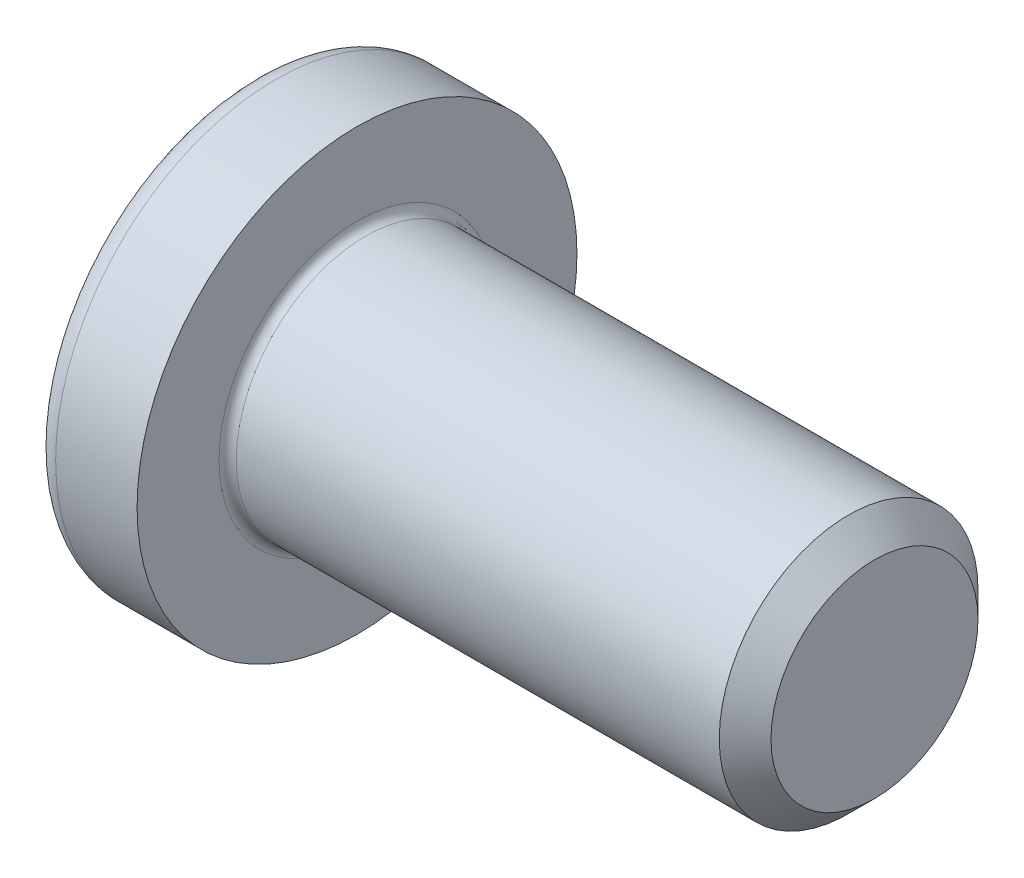
ISO-10303-21;
HEADER;
FILE_DESCRIPTION(('STEP AP214'),'2;1');
FILE_NAME('part.step','',(''),(''),'','','');
FILE_SCHEMA(('AUTOMOTIVE_DESIGN { 1 0 10303 214 1 1 1 1 }'));
ENDSEC;
DATA;
#1=APPLICATION_CONTEXT('core data for automotive mechanical design processes');
#2=APPLICATION_PROTOCOL_DEFINITION('international standard','automotive_design',2000,#1);
#3=PRODUCT_CONTEXT('',#1,'mechanical');
#4=PRODUCT('Part','Part','',(#3));
#5=PRODUCT_RELATED_PRODUCT_CATEGORY('part','',(#4));
#6=PRODUCT_DEFINITION_FORMATION('','',#4);
#7=PRODUCT_DEFINITION_CONTEXT('part definition',#1,'design');
#8=PRODUCT_DEFINITION('design','',#6,#7);
#9=PRODUCT_DEFINITION_SHAPE('','',#8);
#10=(LENGTH_UNIT() NAMED_UNIT(*) SI_UNIT(.MILLI.,.METRE.));
#11=(NAMED_UNIT(*) PLANE_ANGLE_UNIT() SI_UNIT($,.RADIAN.));
#12=(NAMED_UNIT(*) SI_UNIT($,.STERADIAN.) SOLID_ANGLE_UNIT());
#13=UNCERTAINTY_MEASURE_WITH_UNIT(LENGTH_MEASURE(1.E-05),#10,'distance_accuracy_value','');
#14=(GEOMETRIC_REPRESENTATION_CONTEXT(3) GLOBAL_UNCERTAINTY_ASSIGNED_CONTEXT((#13)) GLOBAL_UNIT_ASSIGNED_CONTEXT((#10,
#11,#12)) REPRESENTATION_CONTEXT('',''));
#15=CARTESIAN_POINT('',(0.,0.,0.));
#16=DIRECTION('',(0.,0.,1.));
#17=DIRECTION('',(1.,0.,0.));
#18=AXIS2_PLACEMENT_3D('',#15,#16,#17);
#19=CARTESIAN_POINT('',(5.,0.,0.));
#20=DIRECTION('',(-1.,0.,0.));
#21=DIRECTION('',(0.,1.,0.));
#22=AXIS2_PLACEMENT_3D('',#19,#20,#21);
#23=SPHERICAL_SURFACE('',#22,5.);
#24=CARTESIAN_POINT('',(0.619225335758571,0.,0.));
#25=DIRECTION('',(-1.,0.,0.));
#26=DIRECTION('',(0.,0.,1.));
#27=AXIS2_PLACEMENT_3D('',#24,#25,#26);
#28=CIRCLE('',#27,2.41014799154334);
#29=CARTESIAN_POINT('',(0.619225335758571,0.,2.41014799154334));
#30=VERTEX_POINT('',#29);
#31=EDGE_CURVE('E343',#30,#30,#28,.T.);
#32=ORIENTED_EDGE('',*,*,#31,.T.);
#33=EDGE_LOOP('',(#32));
#34=FACE_BOUND('',#33,.T.);
#35=CARTESIAN_POINT('',(0.04579512008964,0.,0.));
#36=DIRECTION('',(1.,0.,0.));
#37=DIRECTION('',(0.,0.,-1.));
#38=AXIS2_PLACEMENT_3D('',#35,#36,#37);
#39=CIRCLE('',#38,0.675169614150692);
#40=CARTESIAN_POINT('',(0.0457951200896384,-0.449999999999998,-0.503342833337673));
#41=VERTEX_POINT('',#40);
#42=CARTESIAN_POINT('',(0.0457951201179364,-0.503342833335017,-0.45));
#43=VERTEX_POINT('',#42);
#44=EDGE_CURVE('E391',#41,#43,#39,.F.);
#45=ORIENTED_EDGE('',*,*,#44,.F.);
#46=CARTESIAN_POINT('',(5.,-0.45,0.));
#47=DIRECTION('',(0.,1.,0.));
#48=DIRECTION('',(0.,0.,1.));
#49=AXIS2_PLACEMENT_3D('',#46,#47,#48);
#50=CIRCLE('',#49,4.97970882682914);
#51=CARTESIAN_POINT('',(0.286729744391537,-0.449999999999994,-1.60704184687163));
#52=VERTEX_POINT('',#51);
#53=EDGE_CURVE('E409',#52,#41,#50,.T.);
#54=ORIENTED_EDGE('',*,*,#53,.F.);
#55=CARTESIAN_POINT('',(4.70334382550035,0.,0.595000335588224));
#56=DIRECTION('',(0.446197753347436,0.,-0.894934391398443));
#57=DIRECTION('',(-0.894934391398442,0.,-0.446197753347436));
#58=AXIS2_PLACEMENT_3D('',#55,#56,#57);
#59=CIRCLE('',#58,4.95559983400407);
#60=CARTESIAN_POINT('',(0.286729744391538,0.450000000000006,-1.60704184687162));
#61=VERTEX_POINT('',#60);
#62=EDGE_CURVE('E238',#52,#61,#59,.T.);
#63=ORIENTED_EDGE('',*,*,#62,.T.);
#64=CARTESIAN_POINT('',(5.,0.45,0.));
#65=DIRECTION('',(0.,-1.,0.));
#66=DIRECTION('',(0.,0.,-1.));
#67=AXIS2_PLACEMENT_3D('',#64,#65,#66);
#68=CIRCLE('',#67,4.97970882682914);
#69=CARTESIAN_POINT('',(0.0457951200896617,0.450000000000002,-0.503342833337888));
#70=VERTEX_POINT('',#69);
#71=EDGE_CURVE('E332',#70,#61,#68,.T.);
#72=ORIENTED_EDGE('',*,*,#71,.F.);
#73=CARTESIAN_POINT('',(0.0457951200896401,0.503342833337671,-0.45));
#74=VERTEX_POINT('',#73);
#75=EDGE_CURVE('E389',#74,#70,#39,.F.);
#76=ORIENTED_EDGE('',*,*,#75,.F.);
#77=CARTESIAN_POINT('',(5.,0.,-0.45));
#78=DIRECTION('',(0.,0.,1.));
#79=DIRECTION('',(0.,-1.,0.));
#80=AXIS2_PLACEMENT_3D('',#77,#78,#79);
#81=CIRCLE('',#80,4.97970882682914);
#82=CARTESIAN_POINT('',(0.28672974439154,1.60704184687162,-0.45));
#83=VERTEX_POINT('',#82);
#84=EDGE_CURVE('E232',#83,#74,#81,.T.);
#85=ORIENTED_EDGE('',*,*,#84,.F.);
#86=CARTESIAN_POINT('',(4.70334382550035,-0.595000335588225,0.));
#87=DIRECTION('',(0.446197753347436,0.894934391398443,0.));
#88=DIRECTION('',(-0.894934391398442,0.446197753347436,0.));
#89=AXIS2_PLACEMENT_3D('',#86,#87,#88);
#90=CIRCLE('',#89,4.95559983400407);
#91=CARTESIAN_POINT('',(0.286729744391541,1.60704184687162,0.45));
#92=VERTEX_POINT('',#91);
#93=EDGE_CURVE('E235',#83,#92,#90,.T.);
#94=ORIENTED_EDGE('',*,*,#93,.T.);
#95=CARTESIAN_POINT('',(5.,0.,0.45));
#96=DIRECTION('',(0.,0.,-1.));
#97=DIRECTION('',(0.,1.,0.));
#98=AXIS2_PLACEMENT_3D('',#95,#96,#97);
#99=CIRCLE('',#98,4.97970882682914);
#100=CARTESIAN_POINT('',(0.045795120117937,0.503342833335017,0.45));
#101=VERTEX_POINT('',#100);
#102=EDGE_CURVE('E227',#101,#92,#99,.T.);
#103=ORIENTED_EDGE('',*,*,#102,.F.);
#104=CARTESIAN_POINT('',(0.0457951200896394,0.449999999999998,0.503342833337673));
#105=VERTEX_POINT('',#104);
#106=EDGE_CURVE('E392',#105,#101,#39,.F.);
#107=ORIENTED_EDGE('',*,*,#106,.F.);
#108=CARTESIAN_POINT('',(0.286729744391538,0.449999999999994,1.60704184687163));
#109=VERTEX_POINT('',#108);
#110=EDGE_CURVE('E333',#109,#105,#68,.T.);
#111=ORIENTED_EDGE('',*,*,#110,.F.);
#112=CARTESIAN_POINT('',(4.70334382550035,0.,-0.595000335588224));
#113=DIRECTION('',(0.446197753347436,0.,0.894934391398443));
#114=DIRECTION('',(0.894934391398442,0.,-0.446197753347436));
#115=AXIS2_PLACEMENT_3D('',#112,#113,#114);
#116=CIRCLE('',#115,4.95559983400407);
#117=CARTESIAN_POINT('',(0.286729744391537,-0.450000000000006,1.60704184687162));
#118=VERTEX_POINT('',#117);
#119=EDGE_CURVE('E241',#109,#118,#116,.T.);
#120=ORIENTED_EDGE('',*,*,#119,.T.);
#121=CARTESIAN_POINT('',(0.0457951200896617,-0.450000000000002,0.503342833337888));
#122=VERTEX_POINT('',#121);
#123=EDGE_CURVE('E401',#122,#118,#50,.T.);
#124=ORIENTED_EDGE('',*,*,#123,.F.);
#125=CARTESIAN_POINT('',(0.0457951201179362,-0.503342833335017,0.45));
#126=VERTEX_POINT('',#125);
#127=EDGE_CURVE('E60',#126,#122,#39,.F.);
#128=ORIENTED_EDGE('',*,*,#127,.F.);
#129=CARTESIAN_POINT('',(0.286729744391537,-1.60704184687162,0.45));
#130=VERTEX_POINT('',#129);
#131=EDGE_CURVE('E228',#130,#126,#99,.T.);
#132=ORIENTED_EDGE('',*,*,#131,.F.);
#133=CARTESIAN_POINT('',(4.70334382550035,0.595000335588223,0.));
#134=DIRECTION('',(0.446197753347436,-0.894934391398443,0.));
#135=DIRECTION('',(0.894934391398442,0.446197753347436,0.));
#136=AXIS2_PLACEMENT_3D('',#133,#134,#135);
#137=CIRCLE('',#136,4.95559983400407);
#138=CARTESIAN_POINT('',(0.286729744391537,-1.60704184687162,-0.45));
#139=VERTEX_POINT('',#138);
#140=EDGE_CURVE('E218',#130,#139,#137,.T.);
#141=ORIENTED_EDGE('',*,*,#140,.T.);
#142=EDGE_CURVE('E231',#43,#139,#81,.T.);
#143=ORIENTED_EDGE('',*,*,#142,.F.);
#144=EDGE_LOOP('',(#45,#54,#63,#72,#76,#85,#94,#103,#107,#111,#120,#124,#128,#132,#141,#143));
#145=FACE_BOUND('',#144,.T.);
#146=ADVANCED_FACE('F37',(#34,#145),#23,.T.);
#147=CARTESIAN_POINT('',(1.75,0.877482331818931,-0.45));
#148=DIRECTION('',(0.,0.,1.));
#149=DIRECTION('',(0.,-1.,0.));
#150=AXIS2_PLACEMENT_3D('',#147,#148,#149);
#151=PLANE('',#150);
#152=ORIENTED_EDGE('',*,*,#84,.T.);
#153=CARTESIAN_POINT('',(-0.983674468531429,0.596442614644447,-0.45));
#154=CARTESIAN_POINT('',(-0.778484784487605,0.578450280714038,-0.45));
#155=CARTESIAN_POINT('',(-0.573316860965826,0.560200188981624,-0.45));
#156=CARTESIAN_POINT('',(-0.163017653016979,0.522907016012318,-0.45));
#157=CARTESIAN_POINT('',(0.04211361901709,0.503863798764271,-0.45));
#158=CARTESIAN_POINT('',(0.452274395451018,0.464713034802642,-0.45));
#159=CARTESIAN_POINT('',(0.657303900499246,0.444605494960174,-0.45));
#160=CARTESIAN_POINT('',(0.964713459529383,0.413244938032553,-0.45));
#161=CARTESIAN_POINT('',(1.06715466980727,0.402592225216101,-0.45));
#162=CARTESIAN_POINT('',(1.27198494870204,0.38077691937699,-0.45));
#163=CARTESIAN_POINT('',(1.37437401629635,0.369614316716927,-0.45));
#164=CARTESIAN_POINT('',(1.57910422094271,0.346624507563432,-0.45));
#165=CARTESIAN_POINT('',(1.68144533932816,0.334797133729848,-0.45));
#166=CARTESIAN_POINT('',(1.88601467610888,0.310241669630587,-0.45));
#167=CARTESIAN_POINT('',(1.98824290002327,0.297513625573465,-0.45));
#168=CARTESIAN_POINT('',(2.19256272994349,0.270758651376356,-0.45));
#169=CARTESIAN_POINT('',(2.29465428793973,0.256731346995199,-0.45));
#170=CARTESIAN_POINT('',(2.44757216733847,0.234130917746685,-0.45));
#171=CARTESIAN_POINT('',(2.49851255983247,0.226336796758432,-0.45));
#172=CARTESIAN_POINT('',(2.60027916061769,0.210015382535512,-0.45));
#173=CARTESIAN_POINT('',(2.651105360022,0.201488034137144,-0.45));
#174=CARTESIAN_POINT('',(2.70185157125896,0.192487835069277,-0.45));
#175=B_SPLINE_CURVE_WITH_KNOTS('',3,(#153,#154,#155,#156,#157,#158,#159,#160,#161,#162,#163,
#164,#165,#166,#167,#168,#169,#170,#171,#172,#173,#174),.UNSPECIFIED.,.F.,.F.,(4,2,2,2,2,2,2,2,
2,2,4),(0.,0.617932045833623,1.23597049919537,1.85400496307627,2.16298481460555,
2.47197050856609,2.78103433365428,3.09008231381717,3.39921959117497,3.55381464520816,
3.70842134025387),.UNSPECIFIED.);
#176=CARTESIAN_POINT('',(0.600282161685729,0.450000000000002,-0.449999999999999));
#177=VERTEX_POINT('',#176);
#178=EDGE_CURVE('E277',#74,#177,#175,.T.);
#179=ORIENTED_EDGE('',*,*,#178,.T.);
#180=DIRECTION('',(1.,0.,0.));
#181=VECTOR('',#180,1.);
#182=CARTESIAN_POINT('',(1.75,0.450000000000002,-0.45));
#183=LINE('',#182,#181);
#184=CARTESIAN_POINT('',(1.75,0.450000000000002,-0.45));
#185=VERTEX_POINT('',#184);
#186=EDGE_CURVE('E326',#177,#185,#183,.T.);
#187=ORIENTED_EDGE('',*,*,#186,.T.);
#188=DIRECTION('',(0.,1.,0.));
#189=VECTOR('',#188,1.);
#190=CARTESIAN_POINT('',(1.75,-0.877482331818931,-0.45));
#191=LINE('',#190,#189);
#192=CARTESIAN_POINT('',(1.75,0.877482331818931,-0.45));
#193=VERTEX_POINT('',#192);
#194=EDGE_CURVE('E335',#185,#193,#191,.T.);
#195=ORIENTED_EDGE('',*,*,#194,.T.);
#196=DIRECTION('',(0.894934391398442,-0.446197753347436,0.));
#197=VECTOR('',#196,1.);
#198=CARTESIAN_POINT('',(0.,1.75,-0.45));
#199=LINE('',#198,#197);
#200=EDGE_CURVE('E340',#83,#193,#199,.T.);
#201=ORIENTED_EDGE('',*,*,#200,.F.);
#202=EDGE_LOOP('',(#152,#179,#187,#195,#201));
#203=FACE_BOUND('',#202,.T.);
#204=ADVANCED_FACE('F166',(#203),#151,.T.);
#205=DIRECTION('',(-1.,0.,0.));
#206=VECTOR('',#205,1.);
#207=CARTESIAN_POINT('',(1.75,-0.449999999999998,-0.45));
#208=LINE('',#207,#206);
#209=CARTESIAN_POINT('',(1.75,-0.449999999999998,-0.45));
#210=VERTEX_POINT('',#209);
#211=CARTESIAN_POINT('',(0.600282161685762,-0.449999999999998,-0.45));
#212=VERTEX_POINT('',#211);
#213=EDGE_CURVE('E407',#210,#212,#208,.T.);
#214=ORIENTED_EDGE('',*,*,#213,.T.);
#215=CARTESIAN_POINT('',(-0.983674467524667,-0.596442614556258,-0.45));
#216=CARTESIAN_POINT('',(-0.778484783537036,-0.5784502806298,-0.45));
#217=CARTESIAN_POINT('',(-0.573316860071447,-0.560200188901377,-0.45));
#218=CARTESIAN_POINT('',(-0.163017652235162,-0.52290701594017,-0.45));
#219=CARTESIAN_POINT('',(0.0421136197425343,-0.503863798696232,-0.45));
#220=CARTESIAN_POINT('',(0.452274395813954,-0.464713034766789,-0.45));
#221=CARTESIAN_POINT('',(0.657303900556169,-0.444605494953692,-0.45));
#222=CARTESIAN_POINT('',(0.964713459127772,-0.413244938073858,-0.45));
#223=CARTESIAN_POINT('',(1.06715466925295,-0.402592225273951,-0.45));
#224=CARTESIAN_POINT('',(1.27198494784246,-0.380776919469732,-0.45));
#225=CARTESIAN_POINT('',(1.37437401528423,-0.369614316828016,-0.45));
#226=CARTESIAN_POINT('',(1.57910421968958,-0.346624507706723,-0.45));
#227=CARTESIAN_POINT('',(1.6814453379865,-0.334797133886581,-0.45));
#228=CARTESIAN_POINT('',(1.88601467459062,-0.31024166981715,-0.45));
#229=CARTESIAN_POINT('',(1.98824289841693,-0.297513625776414,-0.45));
#230=CARTESIAN_POINT('',(2.19256272816149,-0.270758651617196,-0.45));
#231=CARTESIAN_POINT('',(2.29465428607016,-0.256731347257549,-0.45));
#232=CARTESIAN_POINT('',(2.4475721653388,-0.234130918049218,-0.45));
#233=CARTESIAN_POINT('',(2.49851255778961,-0.226336797075687,-0.45));
#234=CARTESIAN_POINT('',(2.60027915848928,-0.210015382886851,-0.45));
#235=CARTESIAN_POINT('',(2.65110535785124,-0.201488034507846,-0.45));
#236=CARTESIAN_POINT('',(2.70185156904652,-0.192487835462656,-0.45));
#237=B_SPLINE_CURVE_WITH_KNOTS('',3,(#215,#216,#217,#218,#219,#220,#221,#222,#223,#224,#225,
#226,#227,#228,#229,#230,#231,#232,#233,#234,#235,#236),.UNSPECIFIED.,.F.,.F.,(4,2,2,2,2,2,2,2,
2,2,4),(0.,0.617932045664654,1.23597049885687,1.85400496181553,2.162984812884,2.47197050638366,
2.78103433120342,3.09008231109805,3.3992195881869,3.55381464208536,3.7084213369962),.UNSPECIFIED.);
#238=EDGE_CURVE('E263',#212,#43,#237,.F.);
#239=ORIENTED_EDGE('',*,*,#238,.T.);
#240=ORIENTED_EDGE('',*,*,#142,.T.);
#241=DIRECTION('',(0.894934391398442,0.446197753347436,0.));
#242=VECTOR('',#241,1.);
#243=CARTESIAN_POINT('',(0.,-1.75,-0.45));
#244=LINE('',#243,#242);
#245=CARTESIAN_POINT('',(1.75,-0.877482331818931,-0.45));
#246=VERTEX_POINT('',#245);
#247=EDGE_CURVE('E346',#139,#246,#244,.T.);
#248=ORIENTED_EDGE('',*,*,#247,.T.);
#249=EDGE_CURVE('E361',#246,#210,#191,.T.);
#250=ORIENTED_EDGE('',*,*,#249,.T.);
#251=EDGE_LOOP('',(#214,#239,#240,#248,#250));
#252=FACE_BOUND('',#251,.T.);
#253=ADVANCED_FACE('F172',(#252),#151,.T.);
#254=CARTESIAN_POINT('',(1.75,-0.877482331818931,0.45));
#255=DIRECTION('',(0.,0.,-1.));
#256=DIRECTION('',(0.,1.,0.));
#257=AXIS2_PLACEMENT_3D('',#254,#255,#256);
#258=PLANE('',#257);
#259=DIRECTION('',(-1.,0.,0.));
#260=VECTOR('',#259,1.);
#261=CARTESIAN_POINT('',(1.75,0.449999999999998,0.45));
#262=LINE('',#261,#260);
#263=CARTESIAN_POINT('',(1.75,0.449999999999998,0.45));
#264=VERTEX_POINT('',#263);
#265=CARTESIAN_POINT('',(0.600282161685761,0.449999999999998,0.45));
#266=VERTEX_POINT('',#265);
#267=EDGE_CURVE('E337',#264,#266,#262,.T.);
#268=ORIENTED_EDGE('',*,*,#267,.T.);
#269=CARTESIAN_POINT('',(-0.983674467524666,0.596442614556258,0.45));
#270=CARTESIAN_POINT('',(-0.778484783537036,0.5784502806298,0.45));
#271=CARTESIAN_POINT('',(-0.573316860071447,0.560200188901377,0.45));
#272=CARTESIAN_POINT('',(-0.163017652235162,0.52290701594017,0.45));
#273=CARTESIAN_POINT('',(0.042113619742535,0.503863798696232,0.45));
#274=CARTESIAN_POINT('',(0.452274395813955,0.464713034766789,0.45));
#275=CARTESIAN_POINT('',(0.65730390055617,0.444605494953692,0.45));
#276=CARTESIAN_POINT('',(0.964713459127772,0.413244938073858,0.45));
#277=CARTESIAN_POINT('',(1.06715466925295,0.402592225273951,0.45));
#278=CARTESIAN_POINT('',(1.27198494784246,0.380776919469732,0.45));
#279=CARTESIAN_POINT('',(1.37437401528423,0.369614316828016,0.45));
#280=CARTESIAN_POINT('',(1.57910421968958,0.346624507706723,0.45));
#281=CARTESIAN_POINT('',(1.6814453379865,0.334797133886581,0.45));
#282=CARTESIAN_POINT('',(1.88601467459062,0.31024166981715,0.45));
#283=CARTESIAN_POINT('',(1.98824289841693,0.297513625776414,0.45));
#284=CARTESIAN_POINT('',(2.19256272816149,0.270758651617196,0.45));
#285=CARTESIAN_POINT('',(2.29465428607016,0.256731347257549,0.45));
#286=CARTESIAN_POINT('',(2.4475721653388,0.234130918049218,0.45));
#287=CARTESIAN_POINT('',(2.49851255778961,0.226336797075688,0.45));
#288=CARTESIAN_POINT('',(2.60027915848928,0.210015382886852,0.45));
#289=CARTESIAN_POINT('',(2.65110535785124,0.201488034507846,0.45));
#290=CARTESIAN_POINT('',(2.70185156904652,0.192487835462656,0.45));
#291=B_SPLINE_CURVE_WITH_KNOTS('',3,(#269,#270,#271,#272,#273,#274,#275,#276,#277,#278,#279,
#280,#281,#282,#283,#284,#285,#286,#287,#288,#289,#290),.UNSPECIFIED.,.F.,.F.,(4,2,2,2,2,2,2,2,
2,2,4),(0.,0.617932045664654,1.23597049885687,1.85400496181553,2.162984812884,2.47197050638366,
2.78103433120342,3.09008231109805,3.3992195881869,3.55381464208536,3.7084213369962),.UNSPECIFIED.);
#292=EDGE_CURVE('E52',#266,#101,#291,.F.);
#293=ORIENTED_EDGE('',*,*,#292,.T.);
#294=ORIENTED_EDGE('',*,*,#102,.T.);
#295=DIRECTION('',(0.894934391398442,-0.446197753347436,0.));
#296=VECTOR('',#295,1.);
#297=CARTESIAN_POINT('',(0.,1.75,0.45));
#298=LINE('',#297,#296);
#299=CARTESIAN_POINT('',(1.75,0.877482331818931,0.45));
#300=VERTEX_POINT('',#299);
#301=EDGE_CURVE('E344',#92,#300,#298,.T.);
#302=ORIENTED_EDGE('',*,*,#301,.T.);
#303=DIRECTION('',(0.,-1.,0.));
#304=VECTOR('',#303,1.);
#305=CARTESIAN_POINT('',(1.75,0.877482331818931,0.45));
#306=LINE('',#305,#304);
#307=EDGE_CURVE('E354',#300,#264,#306,.T.);
#308=ORIENTED_EDGE('',*,*,#307,.T.);
#309=EDGE_LOOP('',(#268,#293,#294,#302,#308));
#310=FACE_BOUND('',#309,.T.);
#311=ADVANCED_FACE('F384',(#310),#258,.T.);
#312=ORIENTED_EDGE('',*,*,#131,.T.);
#313=CARTESIAN_POINT('',(-0.983674467524667,-0.596442614556259,0.45));
#314=CARTESIAN_POINT('',(-0.778484783537036,-0.5784502806298,0.45));
#315=CARTESIAN_POINT('',(-0.573316860071448,-0.560200188901377,0.45));
#316=CARTESIAN_POINT('',(-0.163017652235163,-0.52290701594017,0.45));
#317=CARTESIAN_POINT('',(0.0421136197425342,-0.503863798696233,0.45));
#318=CARTESIAN_POINT('',(0.452274395813954,-0.464713034766789,0.45));
#319=CARTESIAN_POINT('',(0.65730390055617,-0.444605494953693,0.45));
#320=CARTESIAN_POINT('',(0.964713459127772,-0.413244938073858,0.45));
#321=CARTESIAN_POINT('',(1.06715466925295,-0.402592225273951,0.45));
#322=CARTESIAN_POINT('',(1.27198494784246,-0.380776919469732,0.45));
#323=CARTESIAN_POINT('',(1.37437401528423,-0.369614316828016,0.45));
#324=CARTESIAN_POINT('',(1.57910421968958,-0.346624507706723,0.45));
#325=CARTESIAN_POINT('',(1.6814453379865,-0.334797133886581,0.45));
#326=CARTESIAN_POINT('',(1.88601467459062,-0.310241669817151,0.45));
#327=CARTESIAN_POINT('',(1.98824289841693,-0.297513625776414,0.45));
#328=CARTESIAN_POINT('',(2.19256272816149,-0.270758651617196,0.45));
#329=CARTESIAN_POINT('',(2.29465428607015,-0.256731347257549,0.45));
#330=CARTESIAN_POINT('',(2.4475721653388,-0.234130918049218,0.45));
#331=CARTESIAN_POINT('',(2.49851255778961,-0.226336797075688,0.45));
#332=CARTESIAN_POINT('',(2.60027915848928,-0.210015382886852,0.45));
#333=CARTESIAN_POINT('',(2.65110535785124,-0.201488034507847,0.45));
#334=CARTESIAN_POINT('',(2.70185156904652,-0.192487835462656,0.45));
#335=B_SPLINE_CURVE_WITH_KNOTS('',3,(#313,#314,#315,#316,#317,#318,#319,#320,#321,#322,#323,
#324,#325,#326,#327,#328,#329,#330,#331,#332,#333,#334),.UNSPECIFIED.,.F.,.F.,(4,2,2,2,2,2,2,2,
2,2,4),(0.,0.617932045664654,1.23597049885687,1.85400496181553,2.162984812884,2.47197050638366,
2.78103433120342,3.09008231109805,3.3992195881869,3.55381464208536,3.7084213369962),.UNSPECIFIED.);
#336=CARTESIAN_POINT('',(0.600282161685731,-0.450000000000001,0.449999999999999));
#337=VERTEX_POINT('',#336);
#338=EDGE_CURVE('E288',#126,#337,#335,.T.);
#339=ORIENTED_EDGE('',*,*,#338,.T.);
#340=DIRECTION('',(1.,0.,0.));
#341=VECTOR('',#340,1.);
#342=CARTESIAN_POINT('',(1.75,-0.450000000000002,0.45));
#343=LINE('',#342,#341);
#344=CARTESIAN_POINT('',(1.75,-0.45,0.45));
#345=VERTEX_POINT('',#344);
#346=EDGE_CURVE('E404',#337,#345,#343,.T.);
#347=ORIENTED_EDGE('',*,*,#346,.T.);
#348=CARTESIAN_POINT('',(1.75,-0.877482331818931,0.45));
#349=VERTEX_POINT('',#348);
#350=EDGE_CURVE('E357',#345,#349,#306,.T.);
#351=ORIENTED_EDGE('',*,*,#350,.T.);
#352=DIRECTION('',(0.894934391398442,0.446197753347436,0.));
#353=VECTOR('',#352,1.);
#354=CARTESIAN_POINT('',(0.,-1.75,0.45));
#355=LINE('',#354,#353);
#356=EDGE_CURVE('E348',#130,#349,#355,.T.);
#357=ORIENTED_EDGE('',*,*,#356,.F.);
#358=EDGE_LOOP('',(#312,#339,#347,#351,#357));
#359=FACE_BOUND('',#358,.T.);
#360=ADVANCED_FACE('F314',(#359),#258,.T.);
#361=CARTESIAN_POINT('',(1.75,0.877482331818931,-0.45));
#362=DIRECTION('',(-1.,0.,0.));
#363=DIRECTION('',(0.,0.,1.));
#364=AXIS2_PLACEMENT_3D('',#361,#362,#363);
#365=PLANE('',#364);
#366=ORIENTED_EDGE('',*,*,#350,.F.);
#367=DIRECTION('',(0.,0.,-1.));
#368=VECTOR('',#367,1.);
#369=CARTESIAN_POINT('',(1.75,-0.450000000000003,0.87748233181893));
#370=LINE('',#369,#368);
#371=CARTESIAN_POINT('',(1.75,-0.450000000000003,0.87748233181893));
#372=VERTEX_POINT('',#371);
#373=EDGE_CURVE('E428',#372,#345,#370,.T.);
#374=ORIENTED_EDGE('',*,*,#373,.F.);
#375=DIRECTION('',(0.,1.,0.));
#376=VECTOR('',#375,1.);
#377=CARTESIAN_POINT('',(1.75,-0.450000000000003,0.87748233181893));
#378=LINE('',#377,#376);
#379=CARTESIAN_POINT('',(1.75,0.449999999999997,0.877482331818933));
#380=VERTEX_POINT('',#379);
#381=EDGE_CURVE('E429',#372,#380,#378,.T.);
#382=ORIENTED_EDGE('',*,*,#381,.T.);
#383=DIRECTION('',(0.,0.,1.));
#384=VECTOR('',#383,1.);
#385=CARTESIAN_POINT('',(1.75,0.450000000000003,-0.87748233181893));
#386=LINE('',#385,#384);
#387=EDGE_CURVE('E381',#264,#380,#386,.T.);
#388=ORIENTED_EDGE('',*,*,#387,.F.);
#389=ORIENTED_EDGE('',*,*,#307,.F.);
#390=DIRECTION('',(0.,0.,-1.));
#391=VECTOR('',#390,1.);
#392=CARTESIAN_POINT('',(1.75,0.877482331818931,0.45));
#393=LINE('',#392,#391);
#394=EDGE_CURVE('E358',#300,#193,#393,.T.);
#395=ORIENTED_EDGE('',*,*,#394,.T.);
#396=ORIENTED_EDGE('',*,*,#194,.F.);
#397=CARTESIAN_POINT('',(1.75,0.450000000000003,-0.87748233181893));
#398=VERTEX_POINT('',#397);
#399=EDGE_CURVE('E329',#398,#185,#386,.T.);
#400=ORIENTED_EDGE('',*,*,#399,.F.);
#401=DIRECTION('',(0.,-1.,0.));
#402=VECTOR('',#401,1.);
#403=CARTESIAN_POINT('',(1.75,0.450000000000003,-0.87748233181893));
#404=LINE('',#403,#402);
#405=CARTESIAN_POINT('',(1.75,-0.449999999999997,-0.877482331818933));
#406=VERTEX_POINT('',#405);
#407=EDGE_CURVE('E427',#398,#406,#404,.T.);
#408=ORIENTED_EDGE('',*,*,#407,.T.);
#409=EDGE_CURVE('E425',#210,#406,#370,.T.);
#410=ORIENTED_EDGE('',*,*,#409,.F.);
#411=ORIENTED_EDGE('',*,*,#249,.F.);
#412=DIRECTION('',(0.,0.,1.));
#413=VECTOR('',#412,1.);
#414=CARTESIAN_POINT('',(1.75,-0.877482331818931,-0.45));
#415=LINE('',#414,#413);
#416=EDGE_CURVE('E351',#246,#349,#415,.T.);
#417=ORIENTED_EDGE('',*,*,#416,.T.);
#418=EDGE_LOOP('',(#366,#374,#382,#388,#389,#395,#396,#400,#408,#410,#411,#417));
#419=FACE_BOUND('',#418,.T.);
#420=CARTESIAN_POINT('',(1.75,0.,0.));
#421=DIRECTION('',(-1.,0.,0.));
#422=DIRECTION('',(0.,0.,1.));
#423=AXIS2_PLACEMENT_3D('',#420,#421,#422);
#424=CIRCLE('',#423,0.556);
#425=CARTESIAN_POINT('',(1.75,0.,0.556));
#426=VERTEX_POINT('',#425);
#427=EDGE_CURVE('E395',#426,#426,#424,.T.);
#428=ORIENTED_EDGE('',*,*,#427,.F.);
#429=EDGE_LOOP('',(#428));
#430=FACE_BOUND('',#429,.T.);
#431=ADVANCED_FACE('F305',(#419,#430),#365,.T.);
#432=CARTESIAN_POINT('',(1.75,0.449999999999997,0.877482331818933));
#433=DIRECTION('',(0.,-1.,0.));
#434=DIRECTION('',(0.,0.,-1.));
#435=AXIS2_PLACEMENT_3D('',#432,#433,#434);
#436=PLANE('',#435);
#437=ORIENTED_EDGE('',*,*,#110,.T.);
#438=CARTESIAN_POINT('',(-0.983674468531429,0.449999999999998,0.596442614644449));
#439=CARTESIAN_POINT('',(-0.778484784487605,0.449999999999998,0.57845028071404));
#440=CARTESIAN_POINT('',(-0.573316860965825,0.449999999999998,0.560200188981626));
#441=CARTESIAN_POINT('',(-0.163017653016978,0.449999999999998,0.522907016012319));
#442=CARTESIAN_POINT('',(0.0421136190170905,0.449999999999998,0.503863798764272));
#443=CARTESIAN_POINT('',(0.452274395451018,0.449999999999998,0.464713034802644));
#444=CARTESIAN_POINT('',(0.657303900499245,0.449999999999998,0.444605494960176));
#445=CARTESIAN_POINT('',(0.964713459529383,0.449999999999999,0.413244938032554));
#446=CARTESIAN_POINT('',(1.06715466980727,0.449999999999999,0.402592225216103));
#447=CARTESIAN_POINT('',(1.27198494870204,0.449999999999999,0.380776919376991));
#448=CARTESIAN_POINT('',(1.37437401629635,0.449999999999999,0.369614316716929));
#449=CARTESIAN_POINT('',(1.57910422094271,0.449999999999999,0.346624507563434));
#450=CARTESIAN_POINT('',(1.68144533932816,0.449999999999999,0.334797133729849));
#451=CARTESIAN_POINT('',(1.88601467610888,0.449999999999999,0.310241669630589));
#452=CARTESIAN_POINT('',(1.98824290002327,0.449999999999999,0.297513625573467));
#453=CARTESIAN_POINT('',(2.19256272994349,0.449999999999999,0.270758651376357));
#454=CARTESIAN_POINT('',(2.29465428793973,0.449999999999999,0.256731346995201));
#455=CARTESIAN_POINT('',(2.44757216733847,0.449999999999999,0.234130917746686));
#456=CARTESIAN_POINT('',(2.49851255983247,0.449999999999999,0.226336796758433));
#457=CARTESIAN_POINT('',(2.60027916061769,0.449999999999999,0.210015382535513));
#458=CARTESIAN_POINT('',(2.651105360022,0.449999999999999,0.201488034137145));
#459=CARTESIAN_POINT('',(2.70185157125896,0.449999999999999,0.192487835069278));
#460=B_SPLINE_CURVE_WITH_KNOTS('',3,(#438,#439,#440,#441,#442,#443,#444,#445,#446,#447,#448,
#449,#450,#451,#452,#453,#454,#455,#456,#457,#458,#459),.UNSPECIFIED.,.F.,.F.,(4,2,2,2,2,2,2,2,
2,2,4),(0.,0.617932045833624,1.23597049919537,1.85400496307627,2.16298481460555,
2.47197050856609,2.78103433365428,3.09008231381717,3.39921959117497,3.55381464520816,
3.70842134025387),.UNSPECIFIED.);
#461=EDGE_CURVE('E294',#105,#266,#460,.T.);
#462=ORIENTED_EDGE('',*,*,#461,.T.);
#463=ORIENTED_EDGE('',*,*,#267,.F.);
#464=ORIENTED_EDGE('',*,*,#387,.T.);
#465=DIRECTION('',(0.894934391398442,0.,-0.446197753347436));
#466=VECTOR('',#465,1.);
#467=CARTESIAN_POINT('',(0.,0.449999999999994,1.75));
#468=LINE('',#467,#466);
#469=EDGE_CURVE('E411',#109,#380,#468,.T.);
#470=ORIENTED_EDGE('',*,*,#469,.F.);
#471=EDGE_LOOP('',(#437,#462,#463,#464,#470));
#472=FACE_BOUND('',#471,.T.);
#473=ADVANCED_FACE('F302',(#472),#436,.T.);
#474=CARTESIAN_POINT('',(1.75,-0.449999999999997,-0.877482331818932));
#475=DIRECTION('',(0.,1.,0.));
#476=DIRECTION('',(0.,0.,1.));
#477=AXIS2_PLACEMENT_3D('',#474,#475,#476);
#478=PLANE('',#477);
#479=ORIENTED_EDGE('',*,*,#346,.F.);
#480=CARTESIAN_POINT('',(-0.983674467524667,-0.450000000000002,0.596442614556257));
#481=CARTESIAN_POINT('',(-0.778484783537037,-0.450000000000002,0.578450280629798));
#482=CARTESIAN_POINT('',(-0.573316860071448,-0.450000000000002,0.560200188901375));
#483=CARTESIAN_POINT('',(-0.163017652235163,-0.450000000000002,0.522907015940168));
#484=CARTESIAN_POINT('',(0.0421136197425342,-0.450000000000002,0.503863798696231));
#485=CARTESIAN_POINT('',(0.452274395813954,-0.450000000000001,0.464713034766787));
#486=CARTESIAN_POINT('',(0.65730390055617,-0.450000000000001,0.444605494953691));
#487=CARTESIAN_POINT('',(0.964713459127772,-0.450000000000001,0.413244938073856));
#488=CARTESIAN_POINT('',(1.06715466925295,-0.450000000000001,0.40259222527395));
#489=CARTESIAN_POINT('',(1.27198494784246,-0.450000000000001,0.38077691946973));
#490=CARTESIAN_POINT('',(1.37437401528423,-0.450000000000001,0.369614316828014));
#491=CARTESIAN_POINT('',(1.57910421968958,-0.450000000000001,0.346624507706721));
#492=CARTESIAN_POINT('',(1.6814453379865,-0.450000000000001,0.33479713388658));
#493=CARTESIAN_POINT('',(1.88601467459062,-0.450000000000001,0.310241669817149));
#494=CARTESIAN_POINT('',(1.98824289841693,-0.450000000000001,0.297513625776413));
#495=CARTESIAN_POINT('',(2.19256272816149,-0.450000000000001,0.270758651617195));
#496=CARTESIAN_POINT('',(2.29465428607015,-0.450000000000001,0.256731347257548));
#497=CARTESIAN_POINT('',(2.4475721653388,-0.450000000000001,0.234130918049216));
#498=CARTESIAN_POINT('',(2.49851255778961,-0.450000000000001,0.226336797075686));
#499=CARTESIAN_POINT('',(2.60027915848928,-0.450000000000001,0.21001538288685));
#500=CARTESIAN_POINT('',(2.65110535785124,-0.450000000000001,0.201488034507845));
#501=CARTESIAN_POINT('',(2.70185156904652,-0.450000000000001,0.192487835462654));
#502=B_SPLINE_CURVE_WITH_KNOTS('',3,(#480,#481,#482,#483,#484,#485,#486,#487,#488,#489,#490,
#491,#492,#493,#494,#495,#496,#497,#498,#499,#500,#501),.UNSPECIFIED.,.F.,.F.,(4,2,2,2,2,2,2,2,
2,2,4),(0.,0.617932045664654,1.23597049885687,1.85400496181553,2.162984812884,2.47197050638366,
2.78103433120342,3.09008231109805,3.3992195881869,3.55381464208536,3.7084213369962),.UNSPECIFIED.);
#503=EDGE_CURVE('E283',#337,#122,#502,.F.);
#504=ORIENTED_EDGE('',*,*,#503,.T.);
#505=ORIENTED_EDGE('',*,*,#123,.T.);
#506=DIRECTION('',(0.894934391398442,0.,-0.446197753347436));
#507=VECTOR('',#506,1.);
#508=CARTESIAN_POINT('',(0.,-0.450000000000006,1.75));
#509=LINE('',#508,#507);
#510=EDGE_CURVE('E437',#118,#372,#509,.T.);
#511=ORIENTED_EDGE('',*,*,#510,.T.);
#512=ORIENTED_EDGE('',*,*,#373,.T.);
#513=EDGE_LOOP('',(#479,#504,#505,#511,#512));
#514=FACE_BOUND('',#513,.T.);
#515=ADVANCED_FACE('F250',(#514),#478,.T.);
#516=ORIENTED_EDGE('',*,*,#186,.F.);
#517=CARTESIAN_POINT('',(-0.98367446853143,0.450000000000002,-0.596442614644446));
#518=CARTESIAN_POINT('',(-0.778484784487605,0.450000000000002,-0.578450280714036));
#519=CARTESIAN_POINT('',(-0.573316860965826,0.450000000000002,-0.560200188981622));
#520=CARTESIAN_POINT('',(-0.163017653016979,0.450000000000002,-0.522907016012316));
#521=CARTESIAN_POINT('',(0.0421136190170902,0.450000000000002,-0.503863798764269));
#522=CARTESIAN_POINT('',(0.452274395451017,0.450000000000002,-0.464713034802641));
#523=CARTESIAN_POINT('',(0.657303900499245,0.450000000000002,-0.444605494960173));
#524=CARTESIAN_POINT('',(0.964713459529382,0.450000000000001,-0.413244938032551));
#525=CARTESIAN_POINT('',(1.06715466980727,0.450000000000001,-0.4025922252161));
#526=CARTESIAN_POINT('',(1.27198494870204,0.450000000000001,-0.380776919376988));
#527=CARTESIAN_POINT('',(1.37437401629635,0.450000000000001,-0.369614316716926));
#528=CARTESIAN_POINT('',(1.57910422094271,0.450000000000001,-0.346624507563431));
#529=CARTESIAN_POINT('',(1.68144533932816,0.450000000000001,-0.334797133729846));
#530=CARTESIAN_POINT('',(1.88601467610888,0.450000000000001,-0.310241669630586));
#531=CARTESIAN_POINT('',(1.98824290002327,0.450000000000001,-0.297513625573464));
#532=CARTESIAN_POINT('',(2.19256272994349,0.450000000000001,-0.270758651376354));
#533=CARTESIAN_POINT('',(2.29465428793973,0.450000000000001,-0.256731346995198));
#534=CARTESIAN_POINT('',(2.44757216733847,0.450000000000001,-0.234130917746683));
#535=CARTESIAN_POINT('',(2.49851255983247,0.450000000000001,-0.22633679675843));
#536=CARTESIAN_POINT('',(2.60027916061769,0.450000000000001,-0.21001538253551));
#537=CARTESIAN_POINT('',(2.651105360022,0.450000000000001,-0.201488034137142));
#538=CARTESIAN_POINT('',(2.70185157125896,0.450000000000001,-0.192487835069275));
#539=B_SPLINE_CURVE_WITH_KNOTS('',3,(#517,#518,#519,#520,#521,#522,#523,#524,#525,#526,#527,
#528,#529,#530,#531,#532,#533,#534,#535,#536,#537,#538),.UNSPECIFIED.,.F.,.F.,(4,2,2,2,2,2,2,2,
2,2,4),(0.,0.617932045833624,1.23597049919537,1.85400496307627,2.16298481460555,
2.47197050856609,2.78103433365428,3.09008231381717,3.39921959117497,3.55381464520816,
3.70842134025387),.UNSPECIFIED.);
#540=EDGE_CURVE('E271',#177,#70,#539,.F.);
#541=ORIENTED_EDGE('',*,*,#540,.T.);
#542=ORIENTED_EDGE('',*,*,#71,.T.);
#543=DIRECTION('',(0.894934391398442,0.,0.446197753347436));
#544=VECTOR('',#543,1.);
#545=CARTESIAN_POINT('',(0.,0.450000000000006,-1.75));
#546=LINE('',#545,#544);
#547=EDGE_CURVE('E435',#61,#398,#546,.T.);
#548=ORIENTED_EDGE('',*,*,#547,.T.);
#549=ORIENTED_EDGE('',*,*,#399,.T.);
#550=EDGE_LOOP('',(#516,#541,#542,#548,#549));
#551=FACE_BOUND('',#550,.T.);
#552=ADVANCED_FACE('F307',(#551),#436,.T.);
#553=ORIENTED_EDGE('',*,*,#53,.T.);
#554=CARTESIAN_POINT('',(-0.983674467524667,-0.449999999999998,-0.59644261455626));
#555=CARTESIAN_POINT('',(-0.778484783537036,-0.449999999999998,-0.578450280629802));
#556=CARTESIAN_POINT('',(-0.573316860071447,-0.449999999999998,-0.560200188901379));
#557=CARTESIAN_POINT('',(-0.163017652235163,-0.449999999999998,-0.522907015940172));
#558=CARTESIAN_POINT('',(0.0421136197425345,-0.449999999999998,-0.503863798696234));
#559=CARTESIAN_POINT('',(0.452274395813955,-0.449999999999998,-0.464713034766791));
#560=CARTESIAN_POINT('',(0.65730390055617,-0.449999999999998,-0.444605494953694));
#561=CARTESIAN_POINT('',(0.964713459127772,-0.449999999999998,-0.413244938073859));
#562=CARTESIAN_POINT('',(1.06715466925295,-0.449999999999998,-0.402592225273953));
#563=CARTESIAN_POINT('',(1.27198494784246,-0.449999999999998,-0.380776919469733));
#564=CARTESIAN_POINT('',(1.37437401528423,-0.449999999999998,-0.369614316828017));
#565=CARTESIAN_POINT('',(1.57910421968958,-0.449999999999999,-0.346624507706724));
#566=CARTESIAN_POINT('',(1.6814453379865,-0.449999999999999,-0.334797133886583));
#567=CARTESIAN_POINT('',(1.88601467459062,-0.449999999999999,-0.310241669817152));
#568=CARTESIAN_POINT('',(1.98824289841693,-0.449999999999999,-0.297513625776416));
#569=CARTESIAN_POINT('',(2.19256272816149,-0.449999999999999,-0.270758651617198));
#570=CARTESIAN_POINT('',(2.29465428607015,-0.449999999999999,-0.256731347257551));
#571=CARTESIAN_POINT('',(2.4475721653388,-0.449999999999999,-0.23413091804922));
#572=CARTESIAN_POINT('',(2.49851255778961,-0.449999999999999,-0.226336797075689));
#573=CARTESIAN_POINT('',(2.60027915848928,-0.449999999999999,-0.210015382886853));
#574=CARTESIAN_POINT('',(2.65110535785124,-0.449999999999999,-0.201488034507848));
#575=CARTESIAN_POINT('',(2.70185156904652,-0.449999999999999,-0.192487835462658));
#576=B_SPLINE_CURVE_WITH_KNOTS('',3,(#554,#555,#556,#557,#558,#559,#560,#561,#562,#563,#564,
#565,#566,#567,#568,#569,#570,#571,#572,#573,#574,#575),.UNSPECIFIED.,.F.,.F.,(4,2,2,2,2,2,2,2,
2,2,4),(0.,0.617932045664653,1.23597049885687,1.85400496181553,2.162984812884,2.47197050638366,
2.78103433120342,3.09008231109805,3.3992195881869,3.55381464208536,3.7084213369962),.UNSPECIFIED.);
#577=EDGE_CURVE('E244',#41,#212,#576,.T.);
#578=ORIENTED_EDGE('',*,*,#577,.T.);
#579=ORIENTED_EDGE('',*,*,#213,.F.);
#580=ORIENTED_EDGE('',*,*,#409,.T.);
#581=DIRECTION('',(0.894934391398442,0.,0.446197753347436));
#582=VECTOR('',#581,1.);
#583=CARTESIAN_POINT('',(0.,-0.449999999999993,-1.75));
#584=LINE('',#583,#582);
#585=EDGE_CURVE('E417',#52,#406,#584,.T.);
#586=ORIENTED_EDGE('',*,*,#585,.F.);
#587=EDGE_LOOP('',(#553,#578,#579,#580,#586));
#588=FACE_BOUND('',#587,.T.);
#589=ADVANCED_FACE('F195',(#588),#478,.T.);
#590=CARTESIAN_POINT('',(-25.4,0.,0.));
#591=DIRECTION('',(-1.,0.,0.));
#592=DIRECTION('',(0.,0.,1.));
#593=AXIS2_PLACEMENT_3D('',#590,#591,#592);
#594=CYLINDRICAL_SURFACE('',#593,1.5);
#595=CARTESIAN_POINT('',(7.50000000000001,0.,0.));
#596=DIRECTION('',(1.,0.,0.));
#597=DIRECTION('',(0.,0.,-1.));
#598=AXIS2_PLACEMENT_3D('',#595,#596,#597);
#599=CIRCLE('',#598,1.5);
#600=CARTESIAN_POINT('',(7.50000000000001,0.,-1.5));
#601=VERTEX_POINT('',#600);
#602=EDGE_CURVE('E45',#601,#601,#599,.F.);
#603=ORIENTED_EDGE('',*,*,#602,.T.);
#604=EDGE_LOOP('',(#603));
#605=FACE_BOUND('',#604,.T.);
#606=CARTESIAN_POINT('',(1.9,0.,0.));
#607=DIRECTION('',(-1.,0.,0.));
#608=DIRECTION('',(0.,0.,1.));
#609=AXIS2_PLACEMENT_3D('',#606,#607,#608);
#610=CIRCLE('',#609,1.5);
#611=CARTESIAN_POINT('',(1.9,0.,1.5));
#612=VERTEX_POINT('',#611);
#613=EDGE_CURVE('E212',#612,#612,#610,.F.);
#614=ORIENTED_EDGE('',*,*,#613,.T.);
#615=EDGE_LOOP('',(#614));
#616=FACE_BOUND('',#615,.T.);
#617=ADVANCED_FACE('F192',(#605,#616),#594,.T.);
#618=CARTESIAN_POINT('',(1.8,1.5,0.));
#619=DIRECTION('',(-1.,0.,0.));
#620=DIRECTION('',(0.,0.,1.));
#621=AXIS2_PLACEMENT_3D('',#618,#619,#620);
#622=PLANE('',#621);
#623=CARTESIAN_POINT('',(1.8,0.,0.));
#624=DIRECTION('',(-1.,0.,0.));
#625=DIRECTION('',(0.,0.,1.));
#626=AXIS2_PLACEMENT_3D('',#623,#624,#625);
#627=CIRCLE('',#626,1.6);
#628=CARTESIAN_POINT('',(1.8,0.,1.6));
#629=VERTEX_POINT('',#628);
#630=EDGE_CURVE('E215',#629,#629,#627,.T.);
#631=ORIENTED_EDGE('',*,*,#630,.T.);
#632=EDGE_LOOP('',(#631));
#633=FACE_BOUND('',#632,.T.);
#634=CARTESIAN_POINT('',(1.8,0.,0.));
#635=DIRECTION('',(-1.,0.,0.));
#636=DIRECTION('',(0.,0.,1.));
#637=AXIS2_PLACEMENT_3D('',#634,#635,#636);
#638=CIRCLE('',#637,2.55);
#639=CARTESIAN_POINT('',(1.8,0.,2.55));
#640=VERTEX_POINT('',#639);
#641=EDGE_CURVE('E216',#640,#640,#638,.T.);
#642=ORIENTED_EDGE('',*,*,#641,.F.);
#643=EDGE_LOOP('',(#642));
#644=FACE_BOUND('',#643,.T.);
#645=ADVANCED_FACE('F188',(#633,#644),#622,.F.);
#646=CARTESIAN_POINT('',(-25.4,0.,0.));
#647=DIRECTION('',(-1.,0.,0.));
#648=DIRECTION('',(0.,0.,1.));
#649=AXIS2_PLACEMENT_3D('',#646,#647,#648);
#650=CYLINDRICAL_SURFACE('',#649,2.55);
#651=ORIENTED_EDGE('',*,*,#641,.T.);
#652=EDGE_LOOP('',(#651));
#653=FACE_BOUND('',#652,.T.);
#654=CARTESIAN_POINT('',(0.85578716762761,0.,0.));
#655=DIRECTION('',(-1.,0.,0.));
#656=DIRECTION('',(0.,0.,1.));
#657=AXIS2_PLACEMENT_3D('',#654,#655,#656);
#658=CIRCLE('',#657,2.55);
#659=CARTESIAN_POINT('',(0.85578716762761,0.,2.55));
#660=VERTEX_POINT('',#659);
#661=EDGE_CURVE('E221',#660,#660,#658,.T.);
#662=ORIENTED_EDGE('',*,*,#661,.F.);
#663=EDGE_LOOP('',(#662));
#664=FACE_BOUND('',#663,.T.);
#665=ADVANCED_FACE('F184',(#653,#664),#650,.T.);
#666=CARTESIAN_POINT('',(0.855787167627609,0.,0.));
#667=DIRECTION('',(-1.,0.,0.));
#668=DIRECTION('',(0.,0.,1.));
#669=AXIS2_PLACEMENT_3D('',#666,#667,#668);
#670=TOROIDAL_SURFACE('',#669,2.28,0.27);
#671=ORIENTED_EDGE('',*,*,#661,.T.);
#672=EDGE_LOOP('',(#671));
#673=FACE_BOUND('',#672,.T.);
#674=ORIENTED_EDGE('',*,*,#31,.F.);
#675=EDGE_LOOP('',(#674));
#676=FACE_BOUND('',#675,.T.);
#677=ADVANCED_FACE('F181',(#673,#676),#670,.T.);
#678=CARTESIAN_POINT('',(7.8,1.5,0.));
#679=DIRECTION('',(1.,0.,0.));
#680=DIRECTION('',(0.,0.,-1.));
#681=AXIS2_PLACEMENT_3D('',#678,#679,#680);
#682=PLANE('',#681);
#683=CARTESIAN_POINT('',(7.8,0.,0.));
#684=DIRECTION('',(1.,0.,0.));
#685=DIRECTION('',(0.,0.,-1.));
#686=AXIS2_PLACEMENT_3D('',#683,#684,#685);
#687=CIRCLE('',#686,1.2);
#688=CARTESIAN_POINT('',(7.8,0.,-1.2));
#689=VERTEX_POINT('',#688);
#690=EDGE_CURVE('E11',#689,#689,#687,.T.);
#691=ORIENTED_EDGE('',*,*,#690,.T.);
#692=EDGE_LOOP('',(#691));
#693=FACE_BOUND('',#692,.T.);
#694=ADVANCED_FACE('F179',(#693),#682,.T.);
#695=CARTESIAN_POINT('',(1.9,0.,0.));
#696=DIRECTION('',(-1.,0.,0.));
#697=DIRECTION('',(0.,0.,1.));
#698=AXIS2_PLACEMENT_3D('',#695,#696,#697);
#699=TOROIDAL_SURFACE('',#698,1.6,0.1);
#700=ORIENTED_EDGE('',*,*,#613,.F.);
#701=EDGE_LOOP('',(#700));
#702=FACE_BOUND('',#701,.T.);
#703=ORIENTED_EDGE('',*,*,#630,.F.);
#704=EDGE_LOOP('',(#703));
#705=FACE_BOUND('',#704,.T.);
#706=ADVANCED_FACE('F197',(#702,#705),#699,.F.);
#707=CARTESIAN_POINT('',(1.75,0.877482331818931,0.45));
#708=DIRECTION('',(0.446197753347436,0.894934391398443,0.));
#709=DIRECTION('',(-0.894934391398442,0.446197753347436,0.));
#710=AXIS2_PLACEMENT_3D('',#707,#708,#709);
#711=PLANE('',#710);
#712=ORIENTED_EDGE('',*,*,#200,.T.);
#713=ORIENTED_EDGE('',*,*,#394,.F.);
#714=ORIENTED_EDGE('',*,*,#301,.F.);
#715=ORIENTED_EDGE('',*,*,#93,.F.);
#716=EDGE_LOOP('',(#712,#713,#714,#715));
#717=FACE_BOUND('',#716,.T.);
#718=ADVANCED_FACE('F199',(#717),#711,.F.);
#719=CARTESIAN_POINT('',(0.,-1.75,-0.45));
#720=DIRECTION('',(0.446197753347436,-0.894934391398443,0.));
#721=DIRECTION('',(0.894934391398442,0.446197753347436,0.));
#722=AXIS2_PLACEMENT_3D('',#719,#720,#721);
#723=PLANE('',#722);
#724=ORIENTED_EDGE('',*,*,#356,.T.);
#725=ORIENTED_EDGE('',*,*,#416,.F.);
#726=ORIENTED_EDGE('',*,*,#247,.F.);
#727=ORIENTED_EDGE('',*,*,#140,.F.);
#728=EDGE_LOOP('',(#724,#725,#726,#727));
#729=FACE_BOUND('',#728,.T.);
#730=ADVANCED_FACE('F205',(#729),#723,.F.);
#731=CARTESIAN_POINT('',(1.75,-0.450000000000003,0.87748233181893));
#732=DIRECTION('',(0.446197753347436,0.,0.894934391398443));
#733=DIRECTION('',(-0.894934391398442,0.,0.446197753347436));
#734=AXIS2_PLACEMENT_3D('',#731,#732,#733);
#735=PLANE('',#734);
#736=ORIENTED_EDGE('',*,*,#469,.T.);
#737=ORIENTED_EDGE('',*,*,#381,.F.);
#738=ORIENTED_EDGE('',*,*,#510,.F.);
#739=ORIENTED_EDGE('',*,*,#119,.F.);
#740=EDGE_LOOP('',(#736,#737,#738,#739));
#741=FACE_BOUND('',#740,.T.);
#742=ADVANCED_FACE('F256',(#741),#735,.F.);
#743=CARTESIAN_POINT('',(0.,0.450000000000006,-1.75));
#744=DIRECTION('',(0.446197753347436,0.,-0.894934391398443));
#745=DIRECTION('',(0.894934391398442,0.,0.446197753347436));
#746=AXIS2_PLACEMENT_3D('',#743,#744,#745);
#747=PLANE('',#746);
#748=ORIENTED_EDGE('',*,*,#585,.T.);
#749=ORIENTED_EDGE('',*,*,#407,.F.);
#750=ORIENTED_EDGE('',*,*,#547,.F.);
#751=ORIENTED_EDGE('',*,*,#62,.F.);
#752=EDGE_LOOP('',(#748,#749,#750,#751));
#753=FACE_BOUND('',#752,.T.);
#754=ADVANCED_FACE('F455',(#753),#747,.F.);
#755=CARTESIAN_POINT('',(1.75,0.,0.));
#756=DIRECTION('',(-1.,0.,0.));
#757=DIRECTION('',(0.,0.,1.));
#758=AXIS2_PLACEMENT_3D('',#755,#756,#757);
#759=CONICAL_SURFACE('',#758,0.556,0.069813170079766);
#760=ORIENTED_EDGE('',*,*,#44,.T.);
#761=ORIENTED_EDGE('',*,*,#238,.F.);
#762=ORIENTED_EDGE('',*,*,#577,.F.);
#763=EDGE_LOOP('',(#760,#761,#762));
#764=FACE_BOUND('',#763,.T.);
#765=ADVANCED_FACE('F163',(#764),#759,.F.);
#766=ORIENTED_EDGE('',*,*,#75,.T.);
#767=ORIENTED_EDGE('',*,*,#540,.F.);
#768=ORIENTED_EDGE('',*,*,#178,.F.);
#769=EDGE_LOOP('',(#766,#767,#768));
#770=FACE_BOUND('',#769,.T.);
#771=ADVANCED_FACE('F463',(#770),#759,.F.);
#772=ORIENTED_EDGE('',*,*,#127,.T.);
#773=ORIENTED_EDGE('',*,*,#503,.F.);
#774=ORIENTED_EDGE('',*,*,#338,.F.);
#775=EDGE_LOOP('',(#772,#773,#774));
#776=FACE_BOUND('',#775,.T.);
#777=ADVANCED_FACE('F161',(#776),#759,.F.);
#778=ORIENTED_EDGE('',*,*,#106,.T.);
#779=ORIENTED_EDGE('',*,*,#292,.F.);
#780=ORIENTED_EDGE('',*,*,#461,.F.);
#781=EDGE_LOOP('',(#778,#779,#780));
#782=FACE_BOUND('',#781,.T.);
#783=ADVANCED_FACE('F153',(#782),#759,.F.);
#784=CARTESIAN_POINT('',(1.93065535110549,0.,0.));
#785=DIRECTION('',(-1.,0.,0.));
#786=DIRECTION('',(0.,0.,1.));
#787=AXIS2_PLACEMENT_3D('',#784,#785,#786);
#788=CONICAL_SURFACE('',#787,0.,1.25663706143592);
#789=ORIENTED_EDGE('',*,*,#427,.T.);
#790=EDGE_LOOP('',(#789));
#791=FACE_BOUND('',#790,.T.);
#792=CARTESIAN_POINT('',(1.93065535110549,0.,0.));
#793=VERTEX_POINT('',#792);
#794=VERTEX_LOOP('',#793);
#795=FACE_BOUND('',#794,.T.);
#796=ADVANCED_FACE('F151',(#791,#795),#788,.F.);
#797=CARTESIAN_POINT('',(7.50000000000001,0.,0.));
#798=DIRECTION('',(-1.,0.,0.));
#799=DIRECTION('',(0.,0.,1.));
#800=AXIS2_PLACEMENT_3D('',#797,#798,#799);
#801=CONICAL_SURFACE('',#800,1.5,0.785398163397456);
#802=ORIENTED_EDGE('',*,*,#690,.F.);
#803=EDGE_LOOP('',(#802));
#804=FACE_BOUND('',#803,.T.);
#805=ORIENTED_EDGE('',*,*,#602,.F.);
#806=EDGE_LOOP('',(#805));
#807=FACE_BOUND('',#806,.T.);
#808=ADVANCED_FACE('F39',(#804,#807),#801,.T.);
#809=CLOSED_SHELL('',(#146,#204,#253,#311,#360,#431,#473,#515,#552,#589,#617,#645,#665,#677,
#694,#706,#718,#730,#742,#754,#765,#771,#777,#783,#796,#808));
#810=MANIFOLD_SOLID_BREP('B2',#809);
#811=ADVANCED_BREP_SHAPE_REPRESENTATION('',(#18,#810),#14);
#812=SHAPE_DEFINITION_REPRESENTATION(#9,#811);
ENDSEC;
END-ISO-10303-21;
